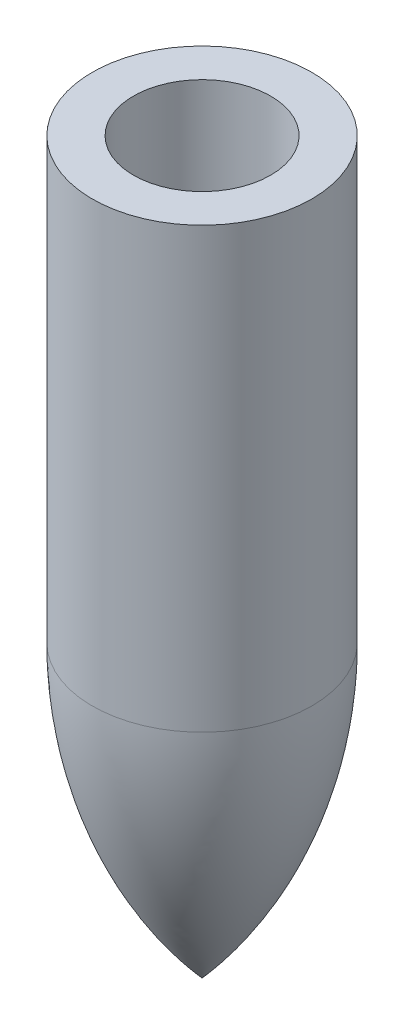
ISO-10303-21;
HEADER;
FILE_DESCRIPTION(('STEP AP214'),'2;1');
FILE_NAME('part.step','',(''),(''),'','','');
FILE_SCHEMA(('AUTOMOTIVE_DESIGN { 1 0 10303 214 1 1 1 1 }'));
ENDSEC;
DATA;
#1=APPLICATION_CONTEXT('core data for automotive mechanical design processes');
#2=APPLICATION_PROTOCOL_DEFINITION('international standard','automotive_design',2000,#1);
#3=PRODUCT_CONTEXT('',#1,'mechanical');
#4=PRODUCT('Part','Part','',(#3));
#5=PRODUCT_RELATED_PRODUCT_CATEGORY('part','',(#4));
#6=PRODUCT_DEFINITION_FORMATION('','',#4);
#7=PRODUCT_DEFINITION_CONTEXT('part definition',#1,'design');
#8=PRODUCT_DEFINITION('design','',#6,#7);
#9=PRODUCT_DEFINITION_SHAPE('','',#8);
#10=(LENGTH_UNIT() NAMED_UNIT(*) SI_UNIT(.MILLI.,.METRE.));
#11=(NAMED_UNIT(*) PLANE_ANGLE_UNIT() SI_UNIT($,.RADIAN.));
#12=(NAMED_UNIT(*) SI_UNIT($,.STERADIAN.) SOLID_ANGLE_UNIT());
#13=UNCERTAINTY_MEASURE_WITH_UNIT(LENGTH_MEASURE(1.E-05),#10,'distance_accuracy_value','');
#14=(GEOMETRIC_REPRESENTATION_CONTEXT(3) GLOBAL_UNCERTAINTY_ASSIGNED_CONTEXT((#13)) GLOBAL_UNIT_ASSIGNED_CONTEXT((#10,
#11,#12)) REPRESENTATION_CONTEXT('',''));
#15=CARTESIAN_POINT('',(0.,0.,0.));
#16=DIRECTION('',(0.,0.,1.));
#17=DIRECTION('',(1.,0.,0.));
#18=AXIS2_PLACEMENT_3D('',#15,#16,#17);
#19=CARTESIAN_POINT('',(12.7,0.,0.));
#20=DIRECTION('',(0.,-1.,0.));
#21=DIRECTION('',(1.,0.,0.));
#22=AXIS2_PLACEMENT_3D('',#19,#20,#21);
#23=PLANE('',#22);
#24=CARTESIAN_POINT('',(12.7,0.,0.));
#25=DIRECTION('',(0.,-1.,0.));
#26=DIRECTION('',(1.,0.,0.));
#27=AXIS2_PLACEMENT_3D('',#24,#25,#26);
#28=CIRCLE('',#27,7.9375);
#29=CARTESIAN_POINT('',(20.6375,0.,0.));
#30=VERTEX_POINT('',#29);
#31=EDGE_CURVE('E63',#30,#30,#28,.T.);
#32=ORIENTED_EDGE('',*,*,#31,.T.);
#33=EDGE_LOOP('',(#32));
#34=FACE_BOUND('',#33,.T.);
#35=CARTESIAN_POINT('',(12.7,0.,0.));
#36=DIRECTION('',(0.,-1.,0.));
#37=DIRECTION('',(1.,0.,0.));
#38=AXIS2_PLACEMENT_3D('',#35,#36,#37);
#39=CIRCLE('',#38,12.7);
#40=CARTESIAN_POINT('',(25.4,0.,0.));
#41=VERTEX_POINT('',#40);
#42=EDGE_CURVE('E11',#41,#41,#39,.T.);
#43=ORIENTED_EDGE('',*,*,#42,.F.);
#44=EDGE_LOOP('',(#43));
#45=FACE_BOUND('',#44,.T.);
#46=ADVANCED_FACE('F39',(#34,#45),#23,.F.);
#47=CARTESIAN_POINT('',(12.7,-84.4010416505203,0.));
#48=DIRECTION('',(0.,-1.,0.));
#49=DIRECTION('',(1.,0.,0.));
#50=AXIS2_PLACEMENT_3D('',#47,#48,#49);
#51=CYLINDRICAL_SURFACE('',#50,12.7);
#52=CARTESIAN_POINT('',(12.7,-50.8,0.));
#53=DIRECTION('',(0.,-1.,0.));
#54=DIRECTION('',(1.,0.,0.));
#55=AXIS2_PLACEMENT_3D('',#52,#53,#54);
#56=CIRCLE('',#55,12.7);
#57=CARTESIAN_POINT('',(25.4,-50.8,0.));
#58=VERTEX_POINT('',#57);
#59=EDGE_CURVE('E47',#58,#58,#56,.T.);
#60=ORIENTED_EDGE('',*,*,#59,.F.);
#61=EDGE_LOOP('',(#60));
#62=FACE_BOUND('',#61,.T.);
#63=ORIENTED_EDGE('',*,*,#42,.T.);
#64=EDGE_LOOP('',(#63));
#65=FACE_BOUND('',#64,.T.);
#66=ADVANCED_FACE('F74',(#62,#65),#51,.T.);
#67=CARTESIAN_POINT('',(-25.4,-50.8,0.));
#68=DIRECTION('',(0.,0.,-1.));
#69=DIRECTION('',(1.,0.,0.));
#70=AXIS2_PLACEMENT_3D('',#67,#68,#69);
#71=CIRCLE('',#70,50.8);
#72=TRIMMED_CURVE('',#71,(PARAMETER_VALUE(-0.722734247813416)),
(PARAMETER_VALUE(0.722734247813416)),.T.,.PARAMETER.);
#73=CARTESIAN_POINT('',(12.7,-50.8,0.));
#74=DIRECTION('',(0.,-1.,0.));
#75=AXIS1_PLACEMENT('',#73,#74);
#76=SURFACE_OF_REVOLUTION('',#72,#75);
#77=CARTESIAN_POINT('',(12.7,-84.4010416505203,0.));
#78=VERTEX_POINT('',#77);
#79=VERTEX_LOOP('',#78);
#80=FACE_BOUND('',#79,.T.);
#81=ORIENTED_EDGE('',*,*,#59,.T.);
#82=EDGE_LOOP('',(#81));
#83=FACE_BOUND('',#82,.T.);
#84=ADVANCED_FACE('F72',(#80,#83),#76,.T.);
#85=CARTESIAN_POINT('',(12.7,-84.4010416505203,0.));
#86=DIRECTION('',(0.,-1.,0.));
#87=DIRECTION('',(1.,0.,0.));
#88=AXIS2_PLACEMENT_3D('',#85,#86,#87);
#89=CYLINDRICAL_SURFACE('',#88,7.9375);
#90=CARTESIAN_POINT('',(12.7,-50.8,0.));
#91=DIRECTION('',(0.,-1.,0.));
#92=DIRECTION('',(1.,0.,0.));
#93=AXIS2_PLACEMENT_3D('',#90,#91,#92);
#94=CIRCLE('',#93,7.93750000000001);
#95=CARTESIAN_POINT('',(20.6375,-50.8,0.));
#96=VERTEX_POINT('',#95);
#97=EDGE_CURVE('E60',#96,#96,#94,.T.);
#98=ORIENTED_EDGE('',*,*,#97,.T.);
#99=EDGE_LOOP('',(#98));
#100=FACE_BOUND('',#99,.T.);
#101=ORIENTED_EDGE('',*,*,#31,.F.);
#102=EDGE_LOOP('',(#101));
#103=FACE_BOUND('',#102,.T.);
#104=ADVANCED_FACE('F56',(#100,#103),#89,.F.);
#105=CARTESIAN_POINT('',(-25.4,-50.8,0.));
#106=DIRECTION('',(0.,0.,-1.));
#107=DIRECTION('',(1.,0.,0.));
#108=AXIS2_PLACEMENT_3D('',#105,#106,#107);
#109=CIRCLE('',#108,46.0375);
#110=TRIMMED_CURVE('',#109,(PARAMETER_VALUE(-0.596002439187514)),
(PARAMETER_VALUE(0.596002439187514)),.T.,.PARAMETER.);
#111=CARTESIAN_POINT('',(12.7,-50.8,0.));
#112=DIRECTION('',(0.,-1.,0.));
#113=AXIS1_PLACEMENT('',#111,#112);
#114=SURFACE_OF_REVOLUTION('',#110,#113);
#115=CARTESIAN_POINT('',(12.7,-76.6426276963083,0.));
#116=VERTEX_POINT('',#115);
#117=VERTEX_LOOP('',#116);
#118=FACE_BOUND('',#117,.T.);
#119=ORIENTED_EDGE('',*,*,#97,.F.);
#120=EDGE_LOOP('',(#119));
#121=FACE_BOUND('',#120,.T.);
#122=ADVANCED_FACE('F53',(#118,#121),#114,.F.);
#123=CLOSED_SHELL('',(#46,#66,#84,#104,#122));
#124=MANIFOLD_SOLID_BREP('B2',#123);
#125=ADVANCED_BREP_SHAPE_REPRESENTATION('',(#18,#124),#14);
#126=SHAPE_DEFINITION_REPRESENTATION(#9,#125);
ENDSEC;
END-ISO-10303-21;
